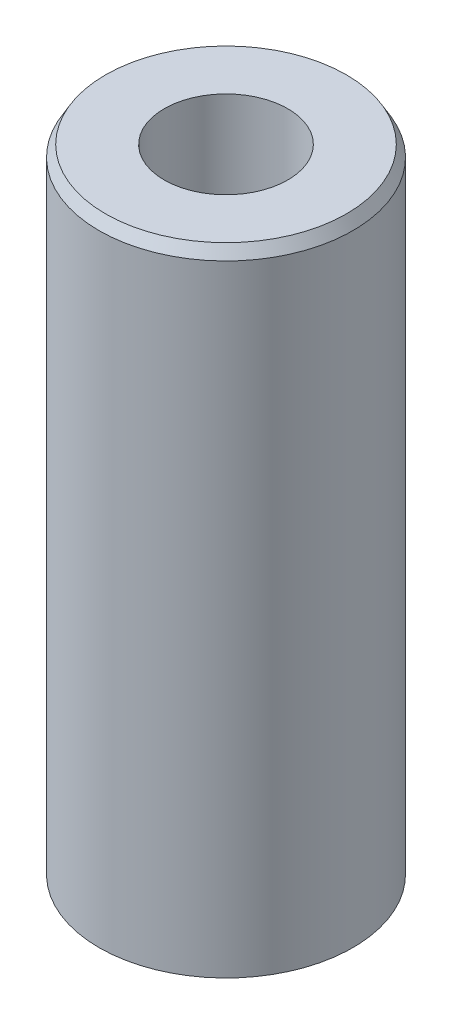
ISO-10303-21;
HEADER;
FILE_DESCRIPTION(('STEP AP214'),'2;1');
FILE_NAME('part.step','',(''),(''),'','','');
FILE_SCHEMA(('AUTOMOTIVE_DESIGN { 1 0 10303 214 1 1 1 1 }'));
ENDSEC;
DATA;
#1=APPLICATION_CONTEXT('core data for automotive mechanical design processes');
#2=APPLICATION_PROTOCOL_DEFINITION('international standard','automotive_design',2000,#1);
#3=PRODUCT_CONTEXT('',#1,'mechanical');
#4=PRODUCT('Part','Part','',(#3));
#5=PRODUCT_RELATED_PRODUCT_CATEGORY('part','',(#4));
#6=PRODUCT_DEFINITION_FORMATION('','',#4);
#7=PRODUCT_DEFINITION_CONTEXT('part definition',#1,'design');
#8=PRODUCT_DEFINITION('design','',#6,#7);
#9=PRODUCT_DEFINITION_SHAPE('','',#8);
#10=(LENGTH_UNIT() NAMED_UNIT(*) SI_UNIT(.MILLI.,.METRE.));
#11=(NAMED_UNIT(*) PLANE_ANGLE_UNIT() SI_UNIT($,.RADIAN.));
#12=(NAMED_UNIT(*) SI_UNIT($,.STERADIAN.) SOLID_ANGLE_UNIT());
#13=UNCERTAINTY_MEASURE_WITH_UNIT(LENGTH_MEASURE(1.E-05),#10,'distance_accuracy_value','');
#14=(GEOMETRIC_REPRESENTATION_CONTEXT(3) GLOBAL_UNCERTAINTY_ASSIGNED_CONTEXT((#13)) GLOBAL_UNIT_ASSIGNED_CONTEXT((#10,
#11,#12)) REPRESENTATION_CONTEXT('',''));
#15=CARTESIAN_POINT('',(0.,0.,0.));
#16=DIRECTION('',(0.,0.,1.));
#17=DIRECTION('',(1.,0.,0.));
#18=AXIS2_PLACEMENT_3D('',#15,#16,#17);
#19=CARTESIAN_POINT('',(0.,100.63088969537,0.));
#20=DIRECTION('',(0.,-1.,0.));
#21=DIRECTION('',(0.,0.,-1.));
#22=AXIS2_PLACEMENT_3D('',#19,#20,#21);
#23=CYLINDRICAL_SURFACE('',#22,20.);
#24=CARTESIAN_POINT('',(0.,98.8557413961555,0.));
#25=DIRECTION('',(0.,1.,0.));
#26=DIRECTION('',(0.,0.,1.));
#27=AXIS2_PLACEMENT_3D('',#24,#25,#26);
#28=CIRCLE('',#27,20.);
#29=CARTESIAN_POINT('',(0.,98.8557413961555,20.));
#30=VERTEX_POINT('',#29);
#31=EDGE_CURVE('E50',#30,#30,#28,.F.);
#32=ORIENTED_EDGE('',*,*,#31,.T.);
#33=EDGE_LOOP('',(#32));
#34=FACE_BOUND('',#33,.T.);
#35=CARTESIAN_POINT('',(0.,1.02488234840292,0.));
#36=DIRECTION('',(0.,1.,0.));
#37=DIRECTION('',(0.,0.,1.));
#38=AXIS2_PLACEMENT_3D('',#35,#36,#37);
#39=CIRCLE('',#38,20.);
#40=CARTESIAN_POINT('',(0.,1.02488234840292,20.));
#41=VERTEX_POINT('',#40);
#42=EDGE_CURVE('E51',#41,#41,#39,.T.);
#43=ORIENTED_EDGE('',*,*,#42,.T.);
#44=EDGE_LOOP('',(#43));
#45=FACE_BOUND('',#44,.T.);
#46=ADVANCED_FACE('F39',(#34,#45),#23,.T.);
#47=CARTESIAN_POINT('',(0.,100.63088969537,0.));
#48=DIRECTION('',(0.,1.,0.));
#49=DIRECTION('',(0.,0.,1.));
#50=AXIS2_PLACEMENT_3D('',#47,#48,#49);
#51=PLANE('',#50);
#52=CARTESIAN_POINT('',(0.,100.63088969537,0.));
#53=DIRECTION('',(0.,1.,0.));
#54=DIRECTION('',(0.,0.,1.));
#55=AXIS2_PLACEMENT_3D('',#52,#53,#54);
#56=CIRCLE('',#55,18.9751176515971);
#57=CARTESIAN_POINT('',(0.,100.63088969537,18.9751176515971));
#58=VERTEX_POINT('',#57);
#59=EDGE_CURVE('E54',#58,#58,#56,.T.);
#60=ORIENTED_EDGE('',*,*,#59,.T.);
#61=EDGE_LOOP('',(#60));
#62=FACE_BOUND('',#61,.T.);
#63=CARTESIAN_POINT('',(0.,100.63088969537,0.));
#64=DIRECTION('',(0.,1.,0.));
#65=DIRECTION('',(0.,0.,1.));
#66=AXIS2_PLACEMENT_3D('',#63,#64,#65);
#67=CIRCLE('',#66,9.73642108403282);
#68=CARTESIAN_POINT('',(0.,100.63088969537,9.73642108403282));
#69=VERTEX_POINT('',#68);
#70=EDGE_CURVE('E58',#69,#69,#67,.T.);
#71=ORIENTED_EDGE('',*,*,#70,.F.);
#72=EDGE_LOOP('',(#71));
#73=FACE_BOUND('',#72,.T.);
#74=ADVANCED_FACE('F69',(#62,#73),#51,.T.);
#75=CARTESIAN_POINT('',(0.,0.,0.));
#76=DIRECTION('',(0.,1.,0.));
#77=DIRECTION('',(0.,0.,1.));
#78=AXIS2_PLACEMENT_3D('',#75,#76,#77);
#79=PLANE('',#78);
#80=CARTESIAN_POINT('',(0.,0.,0.));
#81=DIRECTION('',(0.,1.,0.));
#82=DIRECTION('',(0.,0.,1.));
#83=AXIS2_PLACEMENT_3D('',#80,#81,#82);
#84=CIRCLE('',#83,18.2248517007856);
#85=CARTESIAN_POINT('',(0.,0.,18.2248517007856));
#86=VERTEX_POINT('',#85);
#87=EDGE_CURVE('E10',#86,#86,#84,.F.);
#88=ORIENTED_EDGE('',*,*,#87,.T.);
#89=EDGE_LOOP('',(#88));
#90=FACE_BOUND('',#89,.T.);
#91=CARTESIAN_POINT('',(0.,0.,0.));
#92=DIRECTION('',(0.,1.,0.));
#93=DIRECTION('',(0.,0.,1.));
#94=AXIS2_PLACEMENT_3D('',#91,#92,#93);
#95=CIRCLE('',#94,9.73642108403282);
#96=CARTESIAN_POINT('',(0.,0.,9.73642108403282));
#97=VERTEX_POINT('',#96);
#98=EDGE_CURVE('E63',#97,#97,#95,.T.);
#99=ORIENTED_EDGE('',*,*,#98,.T.);
#100=EDGE_LOOP('',(#99));
#101=FACE_BOUND('',#100,.T.);
#102=ADVANCED_FACE('F75',(#90,#101),#79,.F.);
#103=CARTESIAN_POINT('',(0.,100.63088969537,0.));
#104=DIRECTION('',(0.,-1.,0.));
#105=DIRECTION('',(0.,0.,-1.));
#106=AXIS2_PLACEMENT_3D('',#103,#104,#105);
#107=CYLINDRICAL_SURFACE('',#106,9.73642108403282);
#108=ORIENTED_EDGE('',*,*,#70,.T.);
#109=EDGE_LOOP('',(#108));
#110=FACE_BOUND('',#109,.T.);
#111=ORIENTED_EDGE('',*,*,#98,.F.);
#112=EDGE_LOOP('',(#111));
#113=FACE_BOUND('',#112,.T.);
#114=ADVANCED_FACE('F70',(#110,#113),#107,.F.);
#115=CARTESIAN_POINT('',(0.,100.63088969537,0.));
#116=DIRECTION('',(0.,-1.,0.));
#117=DIRECTION('',(0.,0.,-1.));
#118=AXIS2_PLACEMENT_3D('',#115,#116,#117);
#119=CONICAL_SURFACE('',#118,18.9751176515971,0.523598775598295);
#120=ORIENTED_EDGE('',*,*,#31,.F.);
#121=EDGE_LOOP('',(#120));
#122=FACE_BOUND('',#121,.T.);
#123=ORIENTED_EDGE('',*,*,#59,.F.);
#124=EDGE_LOOP('',(#123));
#125=FACE_BOUND('',#124,.T.);
#126=ADVANCED_FACE('F81',(#122,#125),#119,.T.);
#127=CARTESIAN_POINT('',(0.,1.02488234840292,0.));
#128=DIRECTION('',(0.,1.,0.));
#129=DIRECTION('',(0.,0.,1.));
#130=AXIS2_PLACEMENT_3D('',#127,#128,#129);
#131=CONICAL_SURFACE('',#130,20.,1.0471975511966);
#132=ORIENTED_EDGE('',*,*,#87,.F.);
#133=EDGE_LOOP('',(#132));
#134=FACE_BOUND('',#133,.T.);
#135=ORIENTED_EDGE('',*,*,#42,.F.);
#136=EDGE_LOOP('',(#135));
#137=FACE_BOUND('',#136,.T.);
#138=ADVANCED_FACE('F45',(#134,#137),#131,.T.);
#139=CLOSED_SHELL('',(#46,#74,#102,#114,#126,#138));
#140=MANIFOLD_SOLID_BREP('B2',#139);
#141=ADVANCED_BREP_SHAPE_REPRESENTATION('',(#18,#140),#14);
#142=SHAPE_DEFINITION_REPRESENTATION(#9,#141);
ENDSEC;
END-ISO-10303-21;
